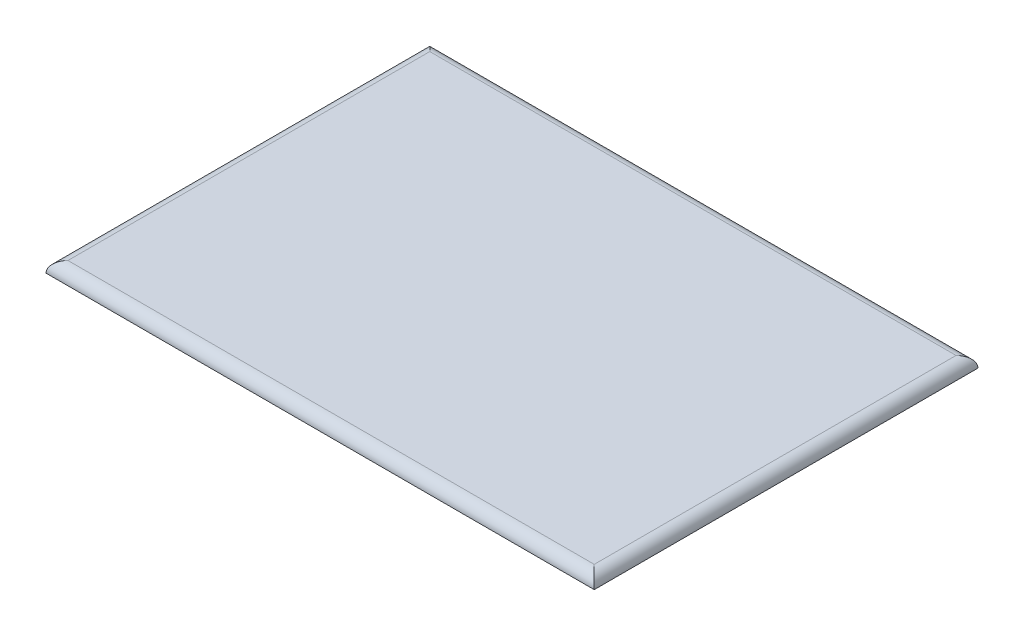
ISO-10303-21;
HEADER;
FILE_DESCRIPTION(('STEP AP214'),'2;1');
FILE_NAME('part.step','',(''),(''),'','','');
FILE_SCHEMA(('AUTOMOTIVE_DESIGN { 1 0 10303 214 1 1 1 1 }'));
ENDSEC;
DATA;
#1=APPLICATION_CONTEXT('core data for automotive mechanical design processes');
#2=APPLICATION_PROTOCOL_DEFINITION('international standard','automotive_design',2000,#1);
#3=PRODUCT_CONTEXT('',#1,'mechanical');
#4=PRODUCT('Part','Part','',(#3));
#5=PRODUCT_RELATED_PRODUCT_CATEGORY('part','',(#4));
#6=PRODUCT_DEFINITION_FORMATION('','',#4);
#7=PRODUCT_DEFINITION_CONTEXT('part definition',#1,'design');
#8=PRODUCT_DEFINITION('design','',#6,#7);
#9=PRODUCT_DEFINITION_SHAPE('','',#8);
#10=(LENGTH_UNIT() NAMED_UNIT(*) SI_UNIT(.MILLI.,.METRE.));
#11=(NAMED_UNIT(*) PLANE_ANGLE_UNIT() SI_UNIT($,.RADIAN.));
#12=(NAMED_UNIT(*) SI_UNIT($,.STERADIAN.) SOLID_ANGLE_UNIT());
#13=UNCERTAINTY_MEASURE_WITH_UNIT(LENGTH_MEASURE(1.E-05),#10,'distance_accuracy_value','');
#14=(GEOMETRIC_REPRESENTATION_CONTEXT(3) GLOBAL_UNCERTAINTY_ASSIGNED_CONTEXT((#13)) GLOBAL_UNIT_ASSIGNED_CONTEXT((#10,
#11,#12)) REPRESENTATION_CONTEXT('',''));
#15=CARTESIAN_POINT('',(0.,0.,0.));
#16=DIRECTION('',(0.,0.,1.));
#17=DIRECTION('',(1.,0.,0.));
#18=AXIS2_PLACEMENT_3D('',#15,#16,#17);
#19=CARTESIAN_POINT('',(0.,2.,0.));
#20=DIRECTION('',(0.,1.,0.));
#21=DIRECTION('',(0.,0.,1.));
#22=AXIS2_PLACEMENT_3D('',#19,#20,#21);
#23=PLANE('',#22);
#24=DIRECTION('',(0.,0.,-1.));
#25=VECTOR('',#24,1.);
#26=CARTESIAN_POINT('',(48.,2.,-35.));
#27=LINE('',#26,#25);
#28=CARTESIAN_POINT('',(48.,2.,33.));
#29=VERTEX_POINT('',#28);
#30=CARTESIAN_POINT('',(48.,2.,-33.));
#31=VERTEX_POINT('',#30);
#32=EDGE_CURVE('E51',#29,#31,#27,.T.);
#33=ORIENTED_EDGE('',*,*,#32,.T.);
#34=DIRECTION('',(-1.,0.,0.));
#35=VECTOR('',#34,1.);
#36=CARTESIAN_POINT('',(-50.,2.,-33.));
#37=LINE('',#36,#35);
#38=CARTESIAN_POINT('',(-48.,2.,-33.));
#39=VERTEX_POINT('',#38);
#40=EDGE_CURVE('E11',#31,#39,#37,.T.);
#41=ORIENTED_EDGE('',*,*,#40,.T.);
#42=DIRECTION('',(0.,0.,1.));
#43=VECTOR('',#42,1.);
#44=CARTESIAN_POINT('',(-48.,2.,35.));
#45=LINE('',#44,#43);
#46=CARTESIAN_POINT('',(-48.,2.,33.));
#47=VERTEX_POINT('',#46);
#48=EDGE_CURVE('E113',#39,#47,#45,.T.);
#49=ORIENTED_EDGE('',*,*,#48,.T.);
#50=DIRECTION('',(1.,0.,0.));
#51=VECTOR('',#50,1.);
#52=CARTESIAN_POINT('',(50.,2.,33.));
#53=LINE('',#52,#51);
#54=EDGE_CURVE('E62',#47,#29,#53,.T.);
#55=ORIENTED_EDGE('',*,*,#54,.T.);
#56=EDGE_LOOP('',(#33,#41,#49,#55));
#57=FACE_BOUND('',#56,.T.);
#58=ADVANCED_FACE('F41',(#57),#23,.T.);
#59=CARTESIAN_POINT('',(0.,0.,0.));
#60=DIRECTION('',(0.,1.,0.));
#61=DIRECTION('',(0.,0.,1.));
#62=AXIS2_PLACEMENT_3D('',#59,#60,#61);
#63=PLANE('',#62);
#64=DIRECTION('',(0.,0.,1.));
#65=VECTOR('',#64,1.);
#66=CARTESIAN_POINT('',(-50.,0.,35.));
#67=LINE('',#66,#65);
#68=CARTESIAN_POINT('',(-50.,0.,-35.));
#69=VERTEX_POINT('',#68);
#70=CARTESIAN_POINT('',(-50.,0.,35.));
#71=VERTEX_POINT('',#70);
#72=EDGE_CURVE('E87',#69,#71,#67,.T.);
#73=ORIENTED_EDGE('',*,*,#72,.F.);
#74=DIRECTION('',(-1.,0.,0.));
#75=VECTOR('',#74,1.);
#76=CARTESIAN_POINT('',(50.,0.,-35.));
#77=LINE('',#76,#75);
#78=CARTESIAN_POINT('',(50.,0.,-35.));
#79=VERTEX_POINT('',#78);
#80=EDGE_CURVE('E110',#79,#69,#77,.T.);
#81=ORIENTED_EDGE('',*,*,#80,.F.);
#82=DIRECTION('',(0.,0.,-1.));
#83=VECTOR('',#82,1.);
#84=CARTESIAN_POINT('',(50.,0.,35.));
#85=LINE('',#84,#83);
#86=CARTESIAN_POINT('',(50.,0.,35.));
#87=VERTEX_POINT('',#86);
#88=EDGE_CURVE('E90',#87,#79,#85,.T.);
#89=ORIENTED_EDGE('',*,*,#88,.F.);
#90=DIRECTION('',(1.,0.,0.));
#91=VECTOR('',#90,1.);
#92=CARTESIAN_POINT('',(50.,0.,35.));
#93=LINE('',#92,#91);
#94=EDGE_CURVE('E82',#71,#87,#93,.T.);
#95=ORIENTED_EDGE('',*,*,#94,.F.);
#96=EDGE_LOOP('',(#73,#81,#89,#95));
#97=FACE_BOUND('',#96,.T.);
#98=ADVANCED_FACE('F84',(#97),#63,.F.);
#99=CARTESIAN_POINT('',(0.,0.,33.));
#100=DIRECTION('',(-1.,0.,0.));
#101=DIRECTION('',(0.,0.,1.));
#102=AXIS2_PLACEMENT_3D('',#99,#100,#101);
#103=CYLINDRICAL_SURFACE('',#102,2.);
#104=CARTESIAN_POINT('',(-48.,0.,33.));
#105=DIRECTION('',(-0.707106781186548,0.,-0.707106781186547));
#106=DIRECTION('',(0.707106781186547,0.,-0.707106781186548));
#107=AXIS2_PLACEMENT_3D('',#104,#105,#106);
#108=ELLIPSE('',#107,2.82842712474619,2.);
#109=EDGE_CURVE('E96',#71,#47,#108,.T.);
#110=ORIENTED_EDGE('',*,*,#109,.F.);
#111=ORIENTED_EDGE('',*,*,#94,.T.);
#112=CARTESIAN_POINT('',(48.,0.,33.));
#113=DIRECTION('',(-0.707106781186547,0.,0.707106781186548));
#114=DIRECTION('',(-0.707106781186548,0.,-0.707106781186547));
#115=AXIS2_PLACEMENT_3D('',#112,#113,#114);
#116=ELLIPSE('',#115,2.82842712474619,2.);
#117=EDGE_CURVE('E45',#29,#87,#116,.F.);
#118=ORIENTED_EDGE('',*,*,#117,.F.);
#119=ORIENTED_EDGE('',*,*,#54,.F.);
#120=EDGE_LOOP('',(#110,#111,#118,#119));
#121=FACE_BOUND('',#120,.T.);
#122=ADVANCED_FACE('F43',(#121),#103,.T.);
#123=CARTESIAN_POINT('',(48.,0.,0.));
#124=DIRECTION('',(0.,0.,1.));
#125=DIRECTION('',(1.,0.,0.));
#126=AXIS2_PLACEMENT_3D('',#123,#124,#125);
#127=CYLINDRICAL_SURFACE('',#126,2.);
#128=ORIENTED_EDGE('',*,*,#117,.T.);
#129=ORIENTED_EDGE('',*,*,#88,.T.);
#130=CARTESIAN_POINT('',(48.,0.,-33.));
#131=DIRECTION('',(0.707106781186548,0.,0.707106781186547));
#132=DIRECTION('',(-0.707106781186547,0.,0.707106781186548));
#133=AXIS2_PLACEMENT_3D('',#130,#131,#132);
#134=ELLIPSE('',#133,2.82842712474619,2.);
#135=EDGE_CURVE('E100',#31,#79,#134,.F.);
#136=ORIENTED_EDGE('',*,*,#135,.F.);
#137=ORIENTED_EDGE('',*,*,#32,.F.);
#138=EDGE_LOOP('',(#128,#129,#136,#137));
#139=FACE_BOUND('',#138,.T.);
#140=ADVANCED_FACE('F127',(#139),#127,.T.);
#141=CARTESIAN_POINT('',(-48.,0.,0.));
#142=DIRECTION('',(0.,0.,-1.));
#143=DIRECTION('',(-1.,0.,0.));
#144=AXIS2_PLACEMENT_3D('',#141,#142,#143);
#145=CYLINDRICAL_SURFACE('',#144,2.);
#146=ORIENTED_EDGE('',*,*,#109,.T.);
#147=ORIENTED_EDGE('',*,*,#48,.F.);
#148=CARTESIAN_POINT('',(-48.,0.,-33.));
#149=DIRECTION('',(0.707106781186547,0.,-0.707106781186548));
#150=DIRECTION('',(-0.707106781186548,0.,-0.707106781186547));
#151=AXIS2_PLACEMENT_3D('',#148,#149,#150);
#152=ELLIPSE('',#151,2.82842712474619,2.);
#153=EDGE_CURVE('E103',#69,#39,#152,.T.);
#154=ORIENTED_EDGE('',*,*,#153,.F.);
#155=ORIENTED_EDGE('',*,*,#72,.T.);
#156=EDGE_LOOP('',(#146,#147,#154,#155));
#157=FACE_BOUND('',#156,.T.);
#158=ADVANCED_FACE('F102',(#157),#145,.T.);
#159=CARTESIAN_POINT('',(0.,0.,-33.));
#160=DIRECTION('',(1.,0.,0.));
#161=DIRECTION('',(0.,0.,-1.));
#162=AXIS2_PLACEMENT_3D('',#159,#160,#161);
#163=CYLINDRICAL_SURFACE('',#162,2.);
#164=ORIENTED_EDGE('',*,*,#135,.T.);
#165=ORIENTED_EDGE('',*,*,#80,.T.);
#166=ORIENTED_EDGE('',*,*,#153,.T.);
#167=ORIENTED_EDGE('',*,*,#40,.F.);
#168=EDGE_LOOP('',(#164,#165,#166,#167));
#169=FACE_BOUND('',#168,.T.);
#170=ADVANCED_FACE('F125',(#169),#163,.T.);
#171=CLOSED_SHELL('',(#58,#98,#122,#140,#158,#170));
#172=MANIFOLD_SOLID_BREP('B2',#171);
#173=ADVANCED_BREP_SHAPE_REPRESENTATION('',(#18,#172),#14);
#174=SHAPE_DEFINITION_REPRESENTATION(#9,#173);
ENDSEC;
END-ISO-10303-21;
